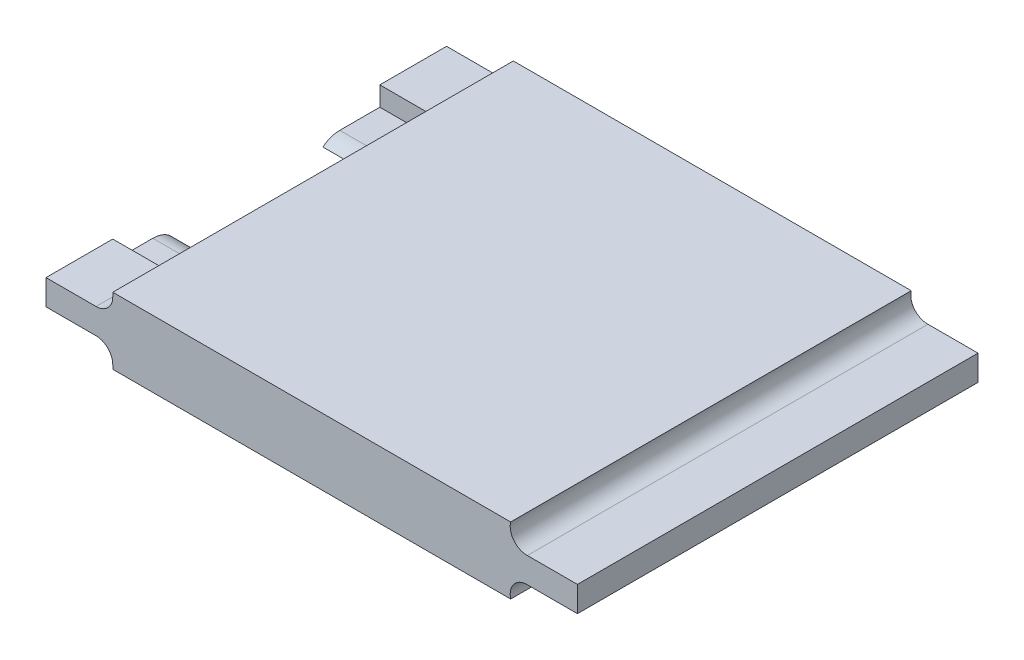
ISO-10303-21;
HEADER;
FILE_DESCRIPTION(('STEP AP214'),'2;1');
FILE_NAME('part.step','',(''),(''),'','','');
FILE_SCHEMA(('AUTOMOTIVE_DESIGN { 1 0 10303 214 1 1 1 1 }'));
ENDSEC;
DATA;
#1=APPLICATION_CONTEXT('core data for automotive mechanical design processes');
#2=APPLICATION_PROTOCOL_DEFINITION('international standard','automotive_design',2000,#1);
#3=PRODUCT_CONTEXT('',#1,'mechanical');
#4=PRODUCT('Part','Part','',(#3));
#5=PRODUCT_RELATED_PRODUCT_CATEGORY('part','',(#4));
#6=PRODUCT_DEFINITION_FORMATION('','',#4);
#7=PRODUCT_DEFINITION_CONTEXT('part definition',#1,'design');
#8=PRODUCT_DEFINITION('design','',#6,#7);
#9=PRODUCT_DEFINITION_SHAPE('','',#8);
#10=(LENGTH_UNIT() NAMED_UNIT(*) SI_UNIT(.MILLI.,.METRE.));
#11=(NAMED_UNIT(*) PLANE_ANGLE_UNIT() SI_UNIT($,.RADIAN.));
#12=(NAMED_UNIT(*) SI_UNIT($,.STERADIAN.) SOLID_ANGLE_UNIT());
#13=UNCERTAINTY_MEASURE_WITH_UNIT(LENGTH_MEASURE(1.E-05),#10,'distance_accuracy_value','');
#14=(GEOMETRIC_REPRESENTATION_CONTEXT(3) GLOBAL_UNCERTAINTY_ASSIGNED_CONTEXT((#13)) GLOBAL_UNIT_ASSIGNED_CONTEXT((#10,
#11,#12)) REPRESENTATION_CONTEXT('',''));
#15=CARTESIAN_POINT('',(0.,0.,0.));
#16=DIRECTION('',(0.,0.,1.));
#17=DIRECTION('',(1.,0.,0.));
#18=AXIS2_PLACEMENT_3D('',#15,#16,#17);
#19=CARTESIAN_POINT('',(-32.3,9.4,60.));
#20=DIRECTION('',(0.,0.,-1.));
#21=DIRECTION('',(-1.,0.,0.));
#22=AXIS2_PLACEMENT_3D('',#19,#20,#21);
#23=CYLINDRICAL_SURFACE('',#22,2.5);
#24=CARTESIAN_POINT('',(-32.3,9.4,9.99999999999999));
#25=DIRECTION('',(0.,0.,1.));
#26=DIRECTION('',(0.,-1.,0.));
#27=AXIS2_PLACEMENT_3D('',#24,#25,#26);
#28=CIRCLE('',#27,2.5);
#29=CARTESIAN_POINT('',(-30.2287684822792,7.99999999999998,9.99999999999999));
#30=VERTEX_POINT('',#29);
#31=CARTESIAN_POINT('',(-32.3,6.9,9.99999999999999));
#32=VERTEX_POINT('',#31);
#33=EDGE_CURVE('E252',#30,#32,#28,.F.);
#34=ORIENTED_EDGE('',*,*,#33,.F.);
#35=DIRECTION('',(0.,0.,-1.));
#36=VECTOR('',#35,1.);
#37=CARTESIAN_POINT('',(-30.2287684822792,8.,60.));
#38=LINE('',#37,#36);
#39=CARTESIAN_POINT('',(-30.2287684822792,8.,50.));
#40=VERTEX_POINT('',#39);
#41=EDGE_CURVE('E14',#30,#40,#38,.F.);
#42=ORIENTED_EDGE('',*,*,#41,.T.);
#43=CARTESIAN_POINT('',(-32.3,9.4,50.));
#44=DIRECTION('',(0.,0.,1.));
#45=DIRECTION('',(1.,0.,0.));
#46=AXIS2_PLACEMENT_3D('',#43,#44,#45);
#47=CIRCLE('',#46,2.5);
#48=CARTESIAN_POINT('',(-32.3,6.9,50.));
#49=VERTEX_POINT('',#48);
#50=EDGE_CURVE('E495',#40,#49,#47,.F.);
#51=ORIENTED_EDGE('',*,*,#50,.T.);
#52=DIRECTION('',(0.,0.,-1.));
#53=VECTOR('',#52,1.);
#54=CARTESIAN_POINT('',(-32.3,6.9,60.));
#55=LINE('',#54,#53);
#56=CARTESIAN_POINT('',(-32.3,6.9,60.));
#57=VERTEX_POINT('',#56);
#58=EDGE_CURVE('E317',#57,#49,#55,.T.);
#59=ORIENTED_EDGE('',*,*,#58,.F.);
#60=CARTESIAN_POINT('',(-32.3,9.4,60.));
#61=DIRECTION('',(0.,0.,1.));
#62=DIRECTION('',(1.,0.,0.));
#63=AXIS2_PLACEMENT_3D('',#60,#61,#62);
#64=CIRCLE('',#63,2.5);
#65=CARTESIAN_POINT('',(-29.8,9.4,60.));
#66=VERTEX_POINT('',#65);
#67=EDGE_CURVE('E187',#66,#57,#64,.F.);
#68=ORIENTED_EDGE('',*,*,#67,.F.);
#69=DIRECTION('',(0.,0.,-1.));
#70=VECTOR('',#69,1.);
#71=CARTESIAN_POINT('',(-29.8,9.4,60.));
#72=LINE('',#71,#70);
#73=CARTESIAN_POINT('',(-29.8,9.4,0.));
#74=VERTEX_POINT('',#73);
#75=EDGE_CURVE('E111',#66,#74,#72,.T.);
#76=ORIENTED_EDGE('',*,*,#75,.T.);
#77=CARTESIAN_POINT('',(-32.3,9.4,0.));
#78=DIRECTION('',(0.,0.,1.));
#79=DIRECTION('',(1.,0.,0.));
#80=AXIS2_PLACEMENT_3D('',#77,#78,#79);
#81=CIRCLE('',#80,2.5);
#82=CARTESIAN_POINT('',(-32.3,6.9,0.));
#83=VERTEX_POINT('',#82);
#84=EDGE_CURVE('E251',#74,#83,#81,.F.);
#85=ORIENTED_EDGE('',*,*,#84,.T.);
#86=EDGE_CURVE('E316',#32,#83,#55,.T.);
#87=ORIENTED_EDGE('',*,*,#86,.F.);
#88=EDGE_LOOP('',(#34,#42,#51,#59,#68,#76,#85,#87));
#89=FACE_BOUND('',#88,.T.);
#90=ADVANCED_FACE('F103',(#89),#23,.F.);
#91=CARTESIAN_POINT('',(0.,6.9,60.));
#92=DIRECTION('',(0.,-1.,0.));
#93=DIRECTION('',(0.,0.,-1.));
#94=AXIS2_PLACEMENT_3D('',#91,#92,#93);
#95=PLANE('',#94);
#96=DIRECTION('',(-1.,0.,0.));
#97=VECTOR('',#96,1.);
#98=CARTESIAN_POINT('',(0.,6.9,9.99999999999999));
#99=LINE('',#98,#97);
#100=CARTESIAN_POINT('',(-39.8,6.9,10.));
#101=VERTEX_POINT('',#100);
#102=EDGE_CURVE('E336',#32,#101,#99,.T.);
#103=ORIENTED_EDGE('',*,*,#102,.F.);
#104=ORIENTED_EDGE('',*,*,#86,.T.);
#105=DIRECTION('',(-1.,0.,0.));
#106=VECTOR('',#105,1.);
#107=CARTESIAN_POINT('',(0.,6.9,0.));
#108=LINE('',#107,#106);
#109=CARTESIAN_POINT('',(-39.8,6.9,0.));
#110=VERTEX_POINT('',#109);
#111=EDGE_CURVE('E255',#83,#110,#108,.T.);
#112=ORIENTED_EDGE('',*,*,#111,.T.);
#113=DIRECTION('',(0.,0.,-1.));
#114=VECTOR('',#113,1.);
#115=CARTESIAN_POINT('',(-39.8,6.9,60.));
#116=LINE('',#115,#114);
#117=EDGE_CURVE('E312',#101,#110,#116,.T.);
#118=ORIENTED_EDGE('',*,*,#117,.F.);
#119=EDGE_LOOP('',(#103,#104,#112,#118));
#120=FACE_BOUND('',#119,.T.);
#121=ADVANCED_FACE('F333',(#120),#95,.F.);
#122=CARTESIAN_POINT('',(-39.8,0.,60.));
#123=DIRECTION('',(1.,0.,0.));
#124=DIRECTION('',(0.,0.,-1.));
#125=AXIS2_PLACEMENT_3D('',#122,#123,#124);
#126=PLANE('',#125);
#127=DIRECTION('',(0.,1.,0.));
#128=VECTOR('',#127,1.);
#129=CARTESIAN_POINT('',(-39.8,0.,10.));
#130=LINE('',#129,#128);
#131=CARTESIAN_POINT('',(-39.8,3.99999999999998,10.));
#132=VERTEX_POINT('',#131);
#133=EDGE_CURVE('E552',#132,#101,#130,.T.);
#134=ORIENTED_EDGE('',*,*,#133,.T.);
#135=ORIENTED_EDGE('',*,*,#117,.T.);
#136=DIRECTION('',(0.,-1.,0.));
#137=VECTOR('',#136,1.);
#138=CARTESIAN_POINT('',(-39.8,0.,0.));
#139=LINE('',#138,#137);
#140=CARTESIAN_POINT('',(-39.8,3.1,0.));
#141=VERTEX_POINT('',#140);
#142=EDGE_CURVE('E258',#110,#141,#139,.T.);
#143=ORIENTED_EDGE('',*,*,#142,.T.);
#144=DIRECTION('',(0.,0.,-1.));
#145=VECTOR('',#144,1.);
#146=CARTESIAN_POINT('',(-39.8,3.1,60.));
#147=LINE('',#146,#145);
#148=CARTESIAN_POINT('',(-39.8,3.1,18.5278449319529));
#149=VERTEX_POINT('',#148);
#150=EDGE_CURVE('E308',#149,#141,#147,.T.);
#151=ORIENTED_EDGE('',*,*,#150,.F.);
#152=CARTESIAN_POINT('',(-39.8,0.,16.));
#153=DIRECTION('',(-1.,0.,0.));
#154=DIRECTION('',(0.,0.,1.));
#155=AXIS2_PLACEMENT_3D('',#152,#153,#154);
#156=CIRCLE('',#155,4.);
#157=CARTESIAN_POINT('',(-39.8,3.99999999999999,16.));
#158=VERTEX_POINT('',#157);
#159=EDGE_CURVE('E448',#149,#158,#156,.T.);
#160=ORIENTED_EDGE('',*,*,#159,.T.);
#161=DIRECTION('',(0.,0.,-1.));
#162=VECTOR('',#161,1.);
#163=CARTESIAN_POINT('',(-39.8,3.99999999999997,0.));
#164=LINE('',#163,#162);
#165=EDGE_CURVE('E553',#158,#132,#164,.T.);
#166=ORIENTED_EDGE('',*,*,#165,.T.);
#167=EDGE_LOOP('',(#134,#135,#143,#151,#160,#166));
#168=FACE_BOUND('',#167,.T.);
#169=ADVANCED_FACE('F549',(#168),#126,.F.);
#170=CARTESIAN_POINT('',(0.,3.1,60.));
#171=DIRECTION('',(0.,1.,0.));
#172=DIRECTION('',(0.,0.,1.));
#173=AXIS2_PLACEMENT_3D('',#170,#171,#172);
#174=PLANE('',#173);
#175=DIRECTION('',(-1.,0.,0.));
#176=VECTOR('',#175,1.);
#177=CARTESIAN_POINT('',(-22.5,3.1,18.5278449319529));
#178=LINE('',#177,#176);
#179=CARTESIAN_POINT('',(-32.3,3.1,18.5278449319529));
#180=VERTEX_POINT('',#179);
#181=EDGE_CURVE('E489',#149,#180,#178,.F.);
#182=ORIENTED_EDGE('',*,*,#181,.F.);
#183=ORIENTED_EDGE('',*,*,#150,.T.);
#184=DIRECTION('',(1.,0.,0.));
#185=VECTOR('',#184,1.);
#186=CARTESIAN_POINT('',(0.,3.1,0.));
#187=LINE('',#186,#185);
#188=CARTESIAN_POINT('',(-32.3,3.1,0.));
#189=VERTEX_POINT('',#188);
#190=EDGE_CURVE('E261',#141,#189,#187,.T.);
#191=ORIENTED_EDGE('',*,*,#190,.T.);
#192=DIRECTION('',(0.,0.,-1.));
#193=VECTOR('',#192,1.);
#194=CARTESIAN_POINT('',(-32.3,3.1,60.));
#195=LINE('',#194,#193);
#196=EDGE_CURVE('E304',#180,#189,#195,.T.);
#197=ORIENTED_EDGE('',*,*,#196,.F.);
#198=EDGE_LOOP('',(#182,#183,#191,#197));
#199=FACE_BOUND('',#198,.T.);
#200=ADVANCED_FACE('F544',(#199),#174,.F.);
#201=CARTESIAN_POINT('',(-32.3,0.6,60.));
#202=DIRECTION('',(0.,0.,-1.));
#203=DIRECTION('',(-1.,0.,0.));
#204=AXIS2_PLACEMENT_3D('',#201,#202,#203);
#205=CYLINDRICAL_SURFACE('',#204,2.5);
#206=CARTESIAN_POINT('',(-32.3,3.1,18.5278449319529));
#207=CARTESIAN_POINT('',(-32.2427783761966,3.10001959279148,18.5277991250683));
#208=CARTESIAN_POINT('',(-32.1855893792816,3.09803637255358,18.5302529364536));
#209=CARTESIAN_POINT('',(-32.0719853521432,3.09022435308074,18.5397992394586));
#210=CARTESIAN_POINT('',(-32.0155689104547,3.08440391729165,18.5468816424886));
#211=CARTESIAN_POINT('',(-31.9047785817545,3.06918800058297,18.5651929682316));
#212=CARTESIAN_POINT('',(-31.8503869073037,3.05984587918695,18.5763599313698));
#213=CARTESIAN_POINT('',(-31.7431590092011,3.03781174261047,18.6023051043512));
#214=CARTESIAN_POINT('',(-31.6903235782667,3.02511805192571,18.6170851201436));
#215=CARTESIAN_POINT('',(-31.5354590256534,2.9826171650465,18.6656754706729));
#216=CARTESIAN_POINT('',(-31.4360480065412,2.94824187650252,18.7039252808654));
#217=CARTESIAN_POINT('',(-31.2446896501938,2.86873035644089,18.7881448275677));
#218=CARTESIAN_POINT('',(-31.1527805575262,2.82354310525713,18.8341508506266));
#219=CARTESIAN_POINT('',(-30.9963446206589,2.73463586133435,18.9197069730532));
#220=CARTESIAN_POINT('',(-30.9302664153485,2.69281416602465,18.9584251649125));
#221=CARTESIAN_POINT('',(-30.8028270134512,2.60362901290673,19.0372140558415));
#222=CARTESIAN_POINT('',(-30.7414677279184,2.55626332929009,19.0772852935084));
#223=CARTESIAN_POINT('',(-30.5644075587497,2.40601512949677,19.1980509374535));
#224=CARTESIAN_POINT('',(-30.4557249325531,2.29498179128109,19.2792969452317));
#225=CARTESIAN_POINT('',(-30.3080698658128,2.11274427232646,19.3973017691196));
#226=CARTESIAN_POINT('',(-30.2612312403755,2.04904983062442,19.436164579342));
#227=CARTESIAN_POINT('',(-30.1732793689853,1.91657815157641,19.5117699845371));
#228=CARTESIAN_POINT('',(-30.1321666940749,1.84780040832418,19.5485123678285));
#229=CARTESIAN_POINT('',(-30.0563702291469,1.7057062529124,19.6189551386471));
#230=CARTESIAN_POINT('',(-30.021663123509,1.63240765089265,19.6526663199712));
#231=CARTESIAN_POINT('',(-29.9591292298411,1.481468189327,19.7164433460602));
#232=CARTESIAN_POINT('',(-29.931296576968,1.40383110093529,19.7465122869118));
#233=CARTESIAN_POINT('',(-29.889942185677,1.26721910691075,19.7944460360402));
#234=CARTESIAN_POINT('',(-29.8745982346269,1.20915731173713,19.8133608600637));
#235=CARTESIAN_POINT('',(-29.8480235320143,1.09137963440562,19.8487230444889));
#236=CARTESIAN_POINT('',(-29.8367912365485,1.03166438218993,19.8651713296895));
#237=CARTESIAN_POINT('',(-29.8185951835575,0.910492386576851,19.8955004952196));
#238=CARTESIAN_POINT('',(-29.8116614371594,0.849026465072671,19.9093628625414));
#239=CARTESIAN_POINT('',(-29.8023569407959,0.725122292391094,19.9342368046447));
#240=CARTESIAN_POINT('',(-29.7999903981387,0.662683198041175,19.9452457427746));
#241=CARTESIAN_POINT('',(-29.8,0.600000000000002,19.954743986657));
#242=B_SPLINE_CURVE_WITH_KNOTS('',3,(#206,#207,#208,#209,#210,#211,#212,#213,#214,#215,#216,
#217,#218,#219,#220,#221,#222,#223,#224,#225,#226,#227,#228,#229,#230,#231,#232,#233,#234,#235,
#236,#237,#238,#239,#240,#241),.UNSPECIFIED.,.F.,.F.,(4,2,2,2,2,2,2,2,2,2,2,2,2,2,2,2,2,4),(0.,
0.171525700600867,0.342678780968912,0.511336537257084,0.680078768482133,1.014451115412,
1.35043355143481,1.61188174328323,1.87343526411908,2.39654448615915,2.66057120517082,
2.92462423643243,3.1876963228302,3.45054319165687,3.63924805950772,3.82788199689718,
4.01781850824386,4.20792990575313),.UNSPECIFIED.);
#243=CARTESIAN_POINT('',(-29.8,0.600000000000001,19.954743986657));
#244=VERTEX_POINT('',#243);
#245=EDGE_CURVE('E484',#180,#244,#242,.T.);
#246=ORIENTED_EDGE('',*,*,#245,.F.);
#247=ORIENTED_EDGE('',*,*,#196,.T.);
#248=CARTESIAN_POINT('',(-32.3,0.6,0.));
#249=DIRECTION('',(0.,0.,1.));
#250=DIRECTION('',(1.,0.,0.));
#251=AXIS2_PLACEMENT_3D('',#248,#249,#250);
#252=CIRCLE('',#251,2.5);
#253=CARTESIAN_POINT('',(-29.8,0.600000000000001,0.));
#254=VERTEX_POINT('',#253);
#255=EDGE_CURVE('E264',#189,#254,#252,.F.);
#256=ORIENTED_EDGE('',*,*,#255,.T.);
#257=DIRECTION('',(0.,0.,-1.));
#258=VECTOR('',#257,1.);
#259=CARTESIAN_POINT('',(-29.8,0.600000000000001,60.));
#260=LINE('',#259,#258);
#261=EDGE_CURVE('E300',#244,#254,#260,.T.);
#262=ORIENTED_EDGE('',*,*,#261,.F.);
#263=EDGE_LOOP('',(#246,#247,#256,#262));
#264=FACE_BOUND('',#263,.T.);
#265=ADVANCED_FACE('F540',(#264),#205,.F.);
#266=CARTESIAN_POINT('',(-29.8,0.,60.));
#267=DIRECTION('',(1.,0.,0.));
#268=DIRECTION('',(0.,0.,-1.));
#269=AXIS2_PLACEMENT_3D('',#266,#267,#268);
#270=PLANE('',#269);
#271=CARTESIAN_POINT('',(-29.8,0.600000000000001,60.));
#272=VERTEX_POINT('',#271);
#273=CARTESIAN_POINT('',(-29.8,0.600000000000001,40.045256013343));
#274=VERTEX_POINT('',#273);
#275=EDGE_CURVE('E301',#272,#274,#260,.T.);
#276=ORIENTED_EDGE('',*,*,#275,.T.);
#277=CARTESIAN_POINT('',(-29.8,0.,44.));
#278=DIRECTION('',(1.,0.,0.));
#279=DIRECTION('',(0.,0.,-1.));
#280=AXIS2_PLACEMENT_3D('',#277,#278,#279);
#281=CIRCLE('',#280,4.);
#282=CARTESIAN_POINT('',(-29.8,0.,40.));
#283=VERTEX_POINT('',#282);
#284=EDGE_CURVE('E452',#274,#283,#281,.F.);
#285=ORIENTED_EDGE('',*,*,#284,.T.);
#286=DIRECTION('',(0.,0.,-1.));
#287=VECTOR('',#286,1.);
#288=CARTESIAN_POINT('',(-29.8,0.,60.));
#289=LINE('',#288,#287);
#290=CARTESIAN_POINT('',(-29.8,0.,60.));
#291=VERTEX_POINT('',#290);
#292=EDGE_CURVE('E297',#291,#283,#289,.T.);
#293=ORIENTED_EDGE('',*,*,#292,.F.);
#294=DIRECTION('',(0.,-1.,0.));
#295=VECTOR('',#294,1.);
#296=CARTESIAN_POINT('',(-29.8,0.,60.));
#297=LINE('',#296,#295);
#298=EDGE_CURVE('E510',#272,#291,#297,.T.);
#299=ORIENTED_EDGE('',*,*,#298,.F.);
#300=EDGE_LOOP('',(#276,#285,#293,#299));
#301=FACE_BOUND('',#300,.T.);
#302=ADVANCED_FACE('F600',(#301),#270,.F.);
#303=CARTESIAN_POINT('',(0.,0.,60.));
#304=DIRECTION('',(0.,1.,0.));
#305=DIRECTION('',(0.,0.,1.));
#306=AXIS2_PLACEMENT_3D('',#303,#304,#305);
#307=PLANE('',#306);
#308=DIRECTION('',(-1.,0.,0.));
#309=VECTOR('',#308,1.);
#310=CARTESIAN_POINT('',(-22.5,0.,20.));
#311=LINE('',#310,#309);
#312=CARTESIAN_POINT('',(-22.5,0.,20.));
#313=VERTEX_POINT('',#312);
#314=CARTESIAN_POINT('',(-29.8,0.,20.));
#315=VERTEX_POINT('',#314);
#316=EDGE_CURVE('E118',#313,#315,#311,.T.);
#317=ORIENTED_EDGE('',*,*,#316,.T.);
#318=CARTESIAN_POINT('',(-29.8,0.,0.));
#319=VERTEX_POINT('',#318);
#320=EDGE_CURVE('E296',#315,#319,#289,.T.);
#321=ORIENTED_EDGE('',*,*,#320,.T.);
#322=DIRECTION('',(1.,0.,0.));
#323=VECTOR('',#322,1.);
#324=CARTESIAN_POINT('',(0.,0.,0.));
#325=LINE('',#324,#323);
#326=CARTESIAN_POINT('',(29.8,0.,0.));
#327=VERTEX_POINT('',#326);
#328=EDGE_CURVE('E270',#319,#327,#325,.T.);
#329=ORIENTED_EDGE('',*,*,#328,.T.);
#330=DIRECTION('',(0.,0.,-1.));
#331=VECTOR('',#330,1.);
#332=CARTESIAN_POINT('',(29.8,0.,60.));
#333=LINE('',#332,#331);
#334=CARTESIAN_POINT('',(29.8,0.,60.));
#335=VERTEX_POINT('',#334);
#336=EDGE_CURVE('E294',#335,#327,#333,.T.);
#337=ORIENTED_EDGE('',*,*,#336,.F.);
#338=DIRECTION('',(1.,0.,0.));
#339=VECTOR('',#338,1.);
#340=CARTESIAN_POINT('',(0.,0.,60.));
#341=LINE('',#340,#339);
#342=EDGE_CURVE('E512',#291,#335,#341,.T.);
#343=ORIENTED_EDGE('',*,*,#342,.F.);
#344=ORIENTED_EDGE('',*,*,#292,.T.);
#345=DIRECTION('',(-1.,0.,0.));
#346=VECTOR('',#345,1.);
#347=CARTESIAN_POINT('',(-22.5,0.,40.));
#348=LINE('',#347,#346);
#349=CARTESIAN_POINT('',(-22.5,0.,40.));
#350=VERTEX_POINT('',#349);
#351=EDGE_CURVE('E417',#350,#283,#348,.T.);
#352=ORIENTED_EDGE('',*,*,#351,.F.);
#353=DIRECTION('',(0.,0.,1.));
#354=VECTOR('',#353,1.);
#355=CARTESIAN_POINT('',(-22.5,0.,0.));
#356=LINE('',#355,#354);
#357=EDGE_CURVE('E425',#313,#350,#356,.T.);
#358=ORIENTED_EDGE('',*,*,#357,.F.);
#359=EDGE_LOOP('',(#317,#321,#329,#337,#343,#344,#352,#358));
#360=FACE_BOUND('',#359,.T.);
#361=ADVANCED_FACE('F432',(#360),#307,.F.);
#362=CARTESIAN_POINT('',(-29.8,0.,60.));
#363=DIRECTION('',(1.,0.,0.));
#364=DIRECTION('',(0.,0.,-1.));
#365=AXIS2_PLACEMENT_3D('',#362,#363,#364);
#366=PLANE('',#365);
#367=DIRECTION('',(0.,-1.,0.));
#368=VECTOR('',#367,1.);
#369=CARTESIAN_POINT('',(-29.8,0.,0.));
#370=LINE('',#369,#368);
#371=CARTESIAN_POINT('',(-29.8,9.99999999999999,0.));
#372=VERTEX_POINT('',#371);
#373=EDGE_CURVE('E248',#372,#74,#370,.T.);
#374=ORIENTED_EDGE('',*,*,#373,.T.);
#375=ORIENTED_EDGE('',*,*,#75,.F.);
#376=DIRECTION('',(0.,-1.,0.));
#377=VECTOR('',#376,1.);
#378=CARTESIAN_POINT('',(-29.8,0.,60.));
#379=LINE('',#378,#377);
#380=CARTESIAN_POINT('',(-29.8,9.99999999999999,60.));
#381=VERTEX_POINT('',#380);
#382=EDGE_CURVE('E286',#381,#66,#379,.T.);
#383=ORIENTED_EDGE('',*,*,#382,.F.);
#384=DIRECTION('',(0.,0.,-1.));
#385=VECTOR('',#384,1.);
#386=CARTESIAN_POINT('',(-29.8,9.99999999999999,60.));
#387=LINE('',#386,#385);
#388=EDGE_CURVE('E244',#381,#372,#387,.T.);
#389=ORIENTED_EDGE('',*,*,#388,.T.);
#390=EDGE_LOOP('',(#374,#375,#383,#389));
#391=FACE_BOUND('',#390,.T.);
#392=ADVANCED_FACE('F105',(#391),#366,.F.);
#393=ORIENTED_EDGE('',*,*,#58,.T.);
#394=DIRECTION('',(-1.,0.,0.));
#395=VECTOR('',#394,1.);
#396=CARTESIAN_POINT('',(0.,6.9,50.));
#397=LINE('',#396,#395);
#398=CARTESIAN_POINT('',(-39.8,6.9,50.));
#399=VERTEX_POINT('',#398);
#400=EDGE_CURVE('E492',#49,#399,#397,.T.);
#401=ORIENTED_EDGE('',*,*,#400,.T.);
#402=CARTESIAN_POINT('',(-39.8,6.9,60.));
#403=VERTEX_POINT('',#402);
#404=EDGE_CURVE('E313',#403,#399,#116,.T.);
#405=ORIENTED_EDGE('',*,*,#404,.F.);
#406=DIRECTION('',(-1.,0.,0.));
#407=VECTOR('',#406,1.);
#408=CARTESIAN_POINT('',(0.,6.9,60.));
#409=LINE('',#408,#407);
#410=EDGE_CURVE('E502',#57,#403,#409,.T.);
#411=ORIENTED_EDGE('',*,*,#410,.F.);
#412=EDGE_LOOP('',(#393,#401,#405,#411));
#413=FACE_BOUND('',#412,.T.);
#414=ADVANCED_FACE('F582',(#413),#95,.F.);
#415=DIRECTION('',(0.,0.,1.));
#416=VECTOR('',#415,1.);
#417=CARTESIAN_POINT('',(-39.8,4.,0.));
#418=LINE('',#417,#416);
#419=CARTESIAN_POINT('',(-39.8,4.,44.));
#420=VERTEX_POINT('',#419);
#421=CARTESIAN_POINT('',(-39.8,4.,50.));
#422=VERTEX_POINT('',#421);
#423=EDGE_CURVE('E558',#420,#422,#418,.T.);
#424=ORIENTED_EDGE('',*,*,#423,.F.);
#425=CARTESIAN_POINT('',(-39.8,0.,44.));
#426=DIRECTION('',(-1.,0.,0.));
#427=DIRECTION('',(0.,0.,1.));
#428=AXIS2_PLACEMENT_3D('',#425,#426,#427);
#429=CIRCLE('',#428,4.);
#430=CARTESIAN_POINT('',(-39.8,3.1,41.4721550680471));
#431=VERTEX_POINT('',#430);
#432=EDGE_CURVE('E575',#431,#420,#429,.F.);
#433=ORIENTED_EDGE('',*,*,#432,.F.);
#434=CARTESIAN_POINT('',(-39.8,3.1,60.));
#435=VERTEX_POINT('',#434);
#436=EDGE_CURVE('E309',#435,#431,#147,.T.);
#437=ORIENTED_EDGE('',*,*,#436,.F.);
#438=DIRECTION('',(0.,-1.,0.));
#439=VECTOR('',#438,1.);
#440=CARTESIAN_POINT('',(-39.8,0.,60.));
#441=LINE('',#440,#439);
#442=EDGE_CURVE('E504',#403,#435,#441,.T.);
#443=ORIENTED_EDGE('',*,*,#442,.F.);
#444=ORIENTED_EDGE('',*,*,#404,.T.);
#445=DIRECTION('',(0.,1.,0.));
#446=VECTOR('',#445,1.);
#447=CARTESIAN_POINT('',(-39.8,0.,50.));
#448=LINE('',#447,#446);
#449=EDGE_CURVE('E555',#422,#399,#448,.T.);
#450=ORIENTED_EDGE('',*,*,#449,.F.);
#451=EDGE_LOOP('',(#424,#433,#437,#443,#444,#450));
#452=FACE_BOUND('',#451,.T.);
#453=ADVANCED_FACE('F576',(#452),#126,.F.);
#454=ORIENTED_EDGE('',*,*,#436,.T.);
#455=DIRECTION('',(-1.,0.,0.));
#456=VECTOR('',#455,1.);
#457=CARTESIAN_POINT('',(-22.5,3.1,41.4721550680471));
#458=LINE('',#457,#456);
#459=CARTESIAN_POINT('',(-32.3,3.1,41.4721550680471));
#460=VERTEX_POINT('',#459);
#461=EDGE_CURVE('E463',#431,#460,#458,.F.);
#462=ORIENTED_EDGE('',*,*,#461,.T.);
#463=CARTESIAN_POINT('',(-32.3,3.1,60.));
#464=VERTEX_POINT('',#463);
#465=EDGE_CURVE('E305',#464,#460,#195,.T.);
#466=ORIENTED_EDGE('',*,*,#465,.F.);
#467=DIRECTION('',(1.,0.,0.));
#468=VECTOR('',#467,1.);
#469=CARTESIAN_POINT('',(0.,3.1,60.));
#470=LINE('',#469,#468);
#471=EDGE_CURVE('E506',#435,#464,#470,.T.);
#472=ORIENTED_EDGE('',*,*,#471,.F.);
#473=EDGE_LOOP('',(#454,#462,#466,#472));
#474=FACE_BOUND('',#473,.T.);
#475=ADVANCED_FACE('F593',(#474),#174,.F.);
#476=ORIENTED_EDGE('',*,*,#465,.T.);
#477=CARTESIAN_POINT('',(-32.3,3.1,41.4721550680471));
#478=CARTESIAN_POINT('',(-32.2427783761966,3.10001959279148,41.4722008749316));
#479=CARTESIAN_POINT('',(-32.1855893792816,3.09803637255358,41.4697470635464));
#480=CARTESIAN_POINT('',(-32.0719853521432,3.09022435308074,41.4602007605414));
#481=CARTESIAN_POINT('',(-32.0155689104547,3.08440391729165,41.4531183575114));
#482=CARTESIAN_POINT('',(-31.9047785817545,3.06918800058297,41.4348070317683));
#483=CARTESIAN_POINT('',(-31.8503869073037,3.05984587918694,41.4236400686301));
#484=CARTESIAN_POINT('',(-31.743159009201,3.03781174261046,41.3976948956488));
#485=CARTESIAN_POINT('',(-31.6903235782667,3.02511805192571,41.3829148798564));
#486=CARTESIAN_POINT('',(-31.5354590256533,2.98261716504649,41.3343245293271));
#487=CARTESIAN_POINT('',(-31.4360480065412,2.94824187650252,41.2960747191346));
#488=CARTESIAN_POINT('',(-31.2446896501938,2.86873035644089,41.2118551724323));
#489=CARTESIAN_POINT('',(-31.1527805575262,2.82354310525713,41.1658491493734));
#490=CARTESIAN_POINT('',(-30.9963446206589,2.73463586133435,41.0802930269467));
#491=CARTESIAN_POINT('',(-30.9302664153485,2.69281416602465,41.0415748350874));
#492=CARTESIAN_POINT('',(-30.8028270134512,2.60362901290673,40.9627859441585));
#493=CARTESIAN_POINT('',(-30.7414677279184,2.55626332929008,40.9227147064916));
#494=CARTESIAN_POINT('',(-30.5644075587497,2.40601512949677,40.8019490625465));
#495=CARTESIAN_POINT('',(-30.4557249325531,2.29498179128108,40.7207030547682));
#496=CARTESIAN_POINT('',(-30.3080698658128,2.11274427232645,40.6026982308804));
#497=CARTESIAN_POINT('',(-30.2612312403754,2.04904983062441,40.563835420658));
#498=CARTESIAN_POINT('',(-30.1732793689853,1.9165781515764,40.4882300154629));
#499=CARTESIAN_POINT('',(-30.1321666940749,1.84780040832417,40.4514876321715));
#500=CARTESIAN_POINT('',(-30.0563702291469,1.7057062529124,40.3810448613529));
#501=CARTESIAN_POINT('',(-30.021663123509,1.63240765089265,40.3473336800287));
#502=CARTESIAN_POINT('',(-29.9591292298411,1.48146818932699,40.2835566539398));
#503=CARTESIAN_POINT('',(-29.931296576968,1.40383110093528,40.2534877130882));
#504=CARTESIAN_POINT('',(-29.889942185677,1.26721910691074,40.2055539639598));
#505=CARTESIAN_POINT('',(-29.8745982346269,1.20915731173713,40.1866391399363));
#506=CARTESIAN_POINT('',(-29.8480235320143,1.09137963440562,40.1512769555111));
#507=CARTESIAN_POINT('',(-29.8367912365485,1.03166438218993,40.1348286703105));
#508=CARTESIAN_POINT('',(-29.8185951835575,0.910492386576847,40.1044995047804));
#509=CARTESIAN_POINT('',(-29.8116614371594,0.849026465072668,40.0906371374586));
#510=CARTESIAN_POINT('',(-29.8023569407959,0.725122292391092,40.0657631953553));
#511=CARTESIAN_POINT('',(-29.7999903981387,0.662683198041174,40.0547542572254));
#512=CARTESIAN_POINT('',(-29.8,0.600000000000001,40.045256013343));
#513=B_SPLINE_CURVE_WITH_KNOTS('',3,(#477,#478,#479,#480,#481,#482,#483,#484,#485,#486,#487,
#488,#489,#490,#491,#492,#493,#494,#495,#496,#497,#498,#499,#500,#501,#502,#503,#504,#505,#506,
#507,#508,#509,#510,#511,#512),.UNSPECIFIED.,.F.,.F.,(4,2,2,2,2,2,2,2,2,2,2,2,2,2,2,2,2,4),(0.,
0.171525700600874,0.342678780968918,0.511336537257091,0.680078768482141,1.01445111541201,
1.35043355143482,1.61188174328323,1.87343526411909,2.39654448615916,2.66057120517083,
2.92462423643243,3.1876963228302,3.45054319165687,3.63924805950772,3.82788199689718,
4.01781850824386,4.20792990575313),.UNSPECIFIED.);
#514=EDGE_CURVE('E454',#460,#274,#513,.T.);
#515=ORIENTED_EDGE('',*,*,#514,.T.);
#516=ORIENTED_EDGE('',*,*,#275,.F.);
#517=CARTESIAN_POINT('',(-32.3,0.6,60.));
#518=DIRECTION('',(0.,0.,1.));
#519=DIRECTION('',(1.,0.,0.));
#520=AXIS2_PLACEMENT_3D('',#517,#518,#519);
#521=CIRCLE('',#520,2.5);
#522=EDGE_CURVE('E508',#464,#272,#521,.F.);
#523=ORIENTED_EDGE('',*,*,#522,.F.);
#524=EDGE_LOOP('',(#476,#515,#516,#523));
#525=FACE_BOUND('',#524,.T.);
#526=ADVANCED_FACE('F465',(#525),#205,.F.);
#527=CARTESIAN_POINT('',(-29.8,0.,16.));
#528=DIRECTION('',(1.,0.,0.));
#529=DIRECTION('',(0.,0.,-1.));
#530=AXIS2_PLACEMENT_3D('',#527,#528,#529);
#531=CIRCLE('',#530,4.);
#532=EDGE_CURVE('E490',#244,#315,#531,.T.);
#533=ORIENTED_EDGE('',*,*,#532,.F.);
#534=ORIENTED_EDGE('',*,*,#261,.T.);
#535=DIRECTION('',(0.,-1.,0.));
#536=VECTOR('',#535,1.);
#537=CARTESIAN_POINT('',(-29.8,0.,0.));
#538=LINE('',#537,#536);
#539=EDGE_CURVE('E267',#254,#319,#538,.T.);
#540=ORIENTED_EDGE('',*,*,#539,.T.);
#541=ORIENTED_EDGE('',*,*,#320,.F.);
#542=EDGE_LOOP('',(#533,#534,#540,#541));
#543=FACE_BOUND('',#542,.T.);
#544=ADVANCED_FACE('F536',(#543),#270,.F.);
#545=CARTESIAN_POINT('',(32.2266659998307,0.601075806588127,60.));
#546=DIRECTION('',(0.,0.,-1.));
#547=DIRECTION('',(-1.,0.,0.));
#548=AXIS2_PLACEMENT_3D('',#545,#546,#547);
#549=CYLINDRICAL_SURFACE('',#548,2.5);
#550=CARTESIAN_POINT('',(32.2266659998307,0.601075806588127,0.));
#551=DIRECTION('',(0.,0.,1.));
#552=DIRECTION('',(1.,0.,0.));
#553=AXIS2_PLACEMENT_3D('',#550,#551,#552);
#554=CIRCLE('',#553,2.5);
#555=CARTESIAN_POINT('',(32.3,3.1,0.));
#556=VERTEX_POINT('',#555);
#557=EDGE_CURVE('E273',#556,#327,#554,.T.);
#558=ORIENTED_EDGE('',*,*,#557,.F.);
#559=DIRECTION('',(0.,0.,-1.));
#560=VECTOR('',#559,1.);
#561=CARTESIAN_POINT('',(32.3,3.1,60.));
#562=LINE('',#561,#560);
#563=CARTESIAN_POINT('',(32.3,3.1,60.));
#564=VERTEX_POINT('',#563);
#565=EDGE_CURVE('E292',#564,#556,#562,.T.);
#566=ORIENTED_EDGE('',*,*,#565,.F.);
#567=CARTESIAN_POINT('',(32.2266659998307,0.601075806588127,60.));
#568=DIRECTION('',(0.,0.,1.));
#569=DIRECTION('',(1.,0.,0.));
#570=AXIS2_PLACEMENT_3D('',#567,#568,#569);
#571=CIRCLE('',#570,2.5);
#572=EDGE_CURVE('E514',#564,#335,#571,.T.);
#573=ORIENTED_EDGE('',*,*,#572,.T.);
#574=ORIENTED_EDGE('',*,*,#336,.T.);
#575=EDGE_LOOP('',(#558,#566,#573,#574));
#576=FACE_BOUND('',#575,.T.);
#577=ADVANCED_FACE('F529',(#576),#549,.F.);
#578=CARTESIAN_POINT('',(0.,3.1,60.));
#579=DIRECTION('',(0.,-1.,0.));
#580=DIRECTION('',(0.,0.,-1.));
#581=AXIS2_PLACEMENT_3D('',#578,#579,#580);
#582=PLANE('',#581);
#583=DIRECTION('',(-1.,0.,0.));
#584=VECTOR('',#583,1.);
#585=CARTESIAN_POINT('',(0.,3.1,0.));
#586=LINE('',#585,#584);
#587=CARTESIAN_POINT('',(39.8,3.1,0.));
#588=VERTEX_POINT('',#587);
#589=EDGE_CURVE('E276',#588,#556,#586,.T.);
#590=ORIENTED_EDGE('',*,*,#589,.F.);
#591=DIRECTION('',(0.,0.,-1.));
#592=VECTOR('',#591,1.);
#593=CARTESIAN_POINT('',(39.8,3.1,60.));
#594=LINE('',#593,#592);
#595=CARTESIAN_POINT('',(39.8,3.1,60.));
#596=VERTEX_POINT('',#595);
#597=EDGE_CURVE('E290',#596,#588,#594,.T.);
#598=ORIENTED_EDGE('',*,*,#597,.F.);
#599=DIRECTION('',(-1.,0.,0.));
#600=VECTOR('',#599,1.);
#601=CARTESIAN_POINT('',(0.,3.1,60.));
#602=LINE('',#601,#600);
#603=EDGE_CURVE('E517',#596,#564,#602,.T.);
#604=ORIENTED_EDGE('',*,*,#603,.T.);
#605=ORIENTED_EDGE('',*,*,#565,.T.);
#606=EDGE_LOOP('',(#590,#598,#604,#605));
#607=FACE_BOUND('',#606,.T.);
#608=ADVANCED_FACE('F526',(#607),#582,.T.);
#609=CARTESIAN_POINT('',(39.8,0.,60.));
#610=DIRECTION('',(1.,0.,0.));
#611=DIRECTION('',(0.,0.,-1.));
#612=AXIS2_PLACEMENT_3D('',#609,#610,#611);
#613=PLANE('',#612);
#614=DIRECTION('',(0.,-1.,0.));
#615=VECTOR('',#614,1.);
#616=CARTESIAN_POINT('',(39.8,0.,0.));
#617=LINE('',#616,#615);
#618=CARTESIAN_POINT('',(39.8,6.9,0.));
#619=VERTEX_POINT('',#618);
#620=EDGE_CURVE('E279',#619,#588,#617,.T.);
#621=ORIENTED_EDGE('',*,*,#620,.F.);
#622=DIRECTION('',(0.,0.,-1.));
#623=VECTOR('',#622,1.);
#624=CARTESIAN_POINT('',(39.8,6.9,60.));
#625=LINE('',#624,#623);
#626=CARTESIAN_POINT('',(39.8,6.9,60.));
#627=VERTEX_POINT('',#626);
#628=EDGE_CURVE('E232',#627,#619,#625,.T.);
#629=ORIENTED_EDGE('',*,*,#628,.F.);
#630=DIRECTION('',(0.,-1.,0.));
#631=VECTOR('',#630,1.);
#632=CARTESIAN_POINT('',(39.8,0.,60.));
#633=LINE('',#632,#631);
#634=EDGE_CURVE('E240',#627,#596,#633,.T.);
#635=ORIENTED_EDGE('',*,*,#634,.T.);
#636=ORIENTED_EDGE('',*,*,#597,.T.);
#637=EDGE_LOOP('',(#621,#629,#635,#636));
#638=FACE_BOUND('',#637,.T.);
#639=ADVANCED_FACE('F521',(#638),#613,.T.);
#640=CARTESIAN_POINT('',(0.,6.9,60.));
#641=DIRECTION('',(0.,1.,0.));
#642=DIRECTION('',(0.,0.,1.));
#643=AXIS2_PLACEMENT_3D('',#640,#641,#642);
#644=PLANE('',#643);
#645=DIRECTION('',(1.,0.,0.));
#646=VECTOR('',#645,1.);
#647=CARTESIAN_POINT('',(0.,6.9,0.));
#648=LINE('',#647,#646);
#649=CARTESIAN_POINT('',(32.3,6.9,0.));
#650=VERTEX_POINT('',#649);
#651=EDGE_CURVE('E227',#650,#619,#648,.T.);
#652=ORIENTED_EDGE('',*,*,#651,.F.);
#653=DIRECTION('',(0.,0.,-1.));
#654=VECTOR('',#653,1.);
#655=CARTESIAN_POINT('',(32.3,6.9,60.));
#656=LINE('',#655,#654);
#657=CARTESIAN_POINT('',(32.3,6.9,60.));
#658=VERTEX_POINT('',#657);
#659=EDGE_CURVE('E222',#658,#650,#656,.T.);
#660=ORIENTED_EDGE('',*,*,#659,.F.);
#661=DIRECTION('',(1.,0.,0.));
#662=VECTOR('',#661,1.);
#663=CARTESIAN_POINT('',(0.,6.9,60.));
#664=LINE('',#663,#662);
#665=EDGE_CURVE('E225',#658,#627,#664,.T.);
#666=ORIENTED_EDGE('',*,*,#665,.T.);
#667=ORIENTED_EDGE('',*,*,#628,.T.);
#668=EDGE_LOOP('',(#652,#660,#666,#667));
#669=FACE_BOUND('',#668,.T.);
#670=ADVANCED_FACE('F224',(#669),#644,.T.);
#671=CARTESIAN_POINT('',(32.2266659998307,9.39892419341187,60.));
#672=DIRECTION('',(0.,0.,-1.));
#673=DIRECTION('',(-1.,0.,0.));
#674=AXIS2_PLACEMENT_3D('',#671,#672,#673);
#675=CYLINDRICAL_SURFACE('',#674,2.5);
#676=CARTESIAN_POINT('',(32.2266659998307,9.39892419341187,0.));
#677=DIRECTION('',(0.,0.,1.));
#678=DIRECTION('',(1.,0.,0.));
#679=AXIS2_PLACEMENT_3D('',#676,#677,#678);
#680=CIRCLE('',#679,2.5);
#681=CARTESIAN_POINT('',(29.8,9.99999999999999,0.));
#682=VERTEX_POINT('',#681);
#683=EDGE_CURVE('E283',#682,#650,#680,.T.);
#684=ORIENTED_EDGE('',*,*,#683,.F.);
#685=DIRECTION('',(0.,0.,-1.));
#686=VECTOR('',#685,1.);
#687=CARTESIAN_POINT('',(29.8,9.99999999999999,60.));
#688=LINE('',#687,#686);
#689=CARTESIAN_POINT('',(29.8,9.99999999999999,60.));
#690=VERTEX_POINT('',#689);
#691=EDGE_CURVE('E233',#690,#682,#688,.T.);
#692=ORIENTED_EDGE('',*,*,#691,.F.);
#693=CARTESIAN_POINT('',(32.2266659998307,9.39892419341187,60.));
#694=DIRECTION('',(0.,0.,1.));
#695=DIRECTION('',(1.,0.,0.));
#696=AXIS2_PLACEMENT_3D('',#693,#694,#695);
#697=CIRCLE('',#696,2.5);
#698=EDGE_CURVE('E237',#690,#658,#697,.T.);
#699=ORIENTED_EDGE('',*,*,#698,.T.);
#700=ORIENTED_EDGE('',*,*,#659,.T.);
#701=EDGE_LOOP('',(#684,#692,#699,#700));
#702=FACE_BOUND('',#701,.T.);
#703=ADVANCED_FACE('F242',(#702),#675,.F.);
#704=CARTESIAN_POINT('',(0.,9.99999999999999,60.));
#705=DIRECTION('',(0.,-1.,0.));
#706=DIRECTION('',(0.,0.,-1.));
#707=AXIS2_PLACEMENT_3D('',#704,#705,#706);
#708=PLANE('',#707);
#709=DIRECTION('',(-1.,0.,0.));
#710=VECTOR('',#709,1.);
#711=CARTESIAN_POINT('',(0.,9.99999999999999,0.));
#712=LINE('',#711,#710);
#713=EDGE_CURVE('E178',#682,#372,#712,.T.);
#714=ORIENTED_EDGE('',*,*,#713,.T.);
#715=ORIENTED_EDGE('',*,*,#388,.F.);
#716=DIRECTION('',(-1.,0.,0.));
#717=VECTOR('',#716,1.);
#718=CARTESIAN_POINT('',(0.,9.99999999999999,60.));
#719=LINE('',#718,#717);
#720=EDGE_CURVE('E127',#690,#381,#719,.T.);
#721=ORIENTED_EDGE('',*,*,#720,.F.);
#722=ORIENTED_EDGE('',*,*,#691,.T.);
#723=EDGE_LOOP('',(#714,#715,#721,#722));
#724=FACE_BOUND('',#723,.T.);
#725=ADVANCED_FACE('F655',(#724),#708,.F.);
#726=CARTESIAN_POINT('',(0.,0.,60.));
#727=DIRECTION('',(0.,0.,1.));
#728=DIRECTION('',(1.,0.,0.));
#729=AXIS2_PLACEMENT_3D('',#726,#727,#728);
#730=PLANE('',#729);
#731=ORIENTED_EDGE('',*,*,#382,.T.);
#732=ORIENTED_EDGE('',*,*,#67,.T.);
#733=ORIENTED_EDGE('',*,*,#410,.T.);
#734=ORIENTED_EDGE('',*,*,#442,.T.);
#735=ORIENTED_EDGE('',*,*,#471,.T.);
#736=ORIENTED_EDGE('',*,*,#522,.T.);
#737=ORIENTED_EDGE('',*,*,#298,.T.);
#738=ORIENTED_EDGE('',*,*,#342,.T.);
#739=ORIENTED_EDGE('',*,*,#572,.F.);
#740=ORIENTED_EDGE('',*,*,#603,.F.);
#741=ORIENTED_EDGE('',*,*,#634,.F.);
#742=ORIENTED_EDGE('',*,*,#665,.F.);
#743=ORIENTED_EDGE('',*,*,#698,.F.);
#744=ORIENTED_EDGE('',*,*,#720,.T.);
#745=EDGE_LOOP('',(#731,#732,#733,#734,#735,#736,#737,#738,#739,#740,#741,#742,#743,#744));
#746=FACE_BOUND('',#745,.T.);
#747=ADVANCED_FACE('F236',(#746),#730,.T.);
#748=CARTESIAN_POINT('',(0.,0.,0.));
#749=DIRECTION('',(0.,0.,1.));
#750=DIRECTION('',(1.,0.,0.));
#751=AXIS2_PLACEMENT_3D('',#748,#749,#750);
#752=PLANE('',#751);
#753=ORIENTED_EDGE('',*,*,#373,.F.);
#754=ORIENTED_EDGE('',*,*,#713,.F.);
#755=ORIENTED_EDGE('',*,*,#683,.T.);
#756=ORIENTED_EDGE('',*,*,#651,.T.);
#757=ORIENTED_EDGE('',*,*,#620,.T.);
#758=ORIENTED_EDGE('',*,*,#589,.T.);
#759=ORIENTED_EDGE('',*,*,#557,.T.);
#760=ORIENTED_EDGE('',*,*,#328,.F.);
#761=ORIENTED_EDGE('',*,*,#539,.F.);
#762=ORIENTED_EDGE('',*,*,#255,.F.);
#763=ORIENTED_EDGE('',*,*,#190,.F.);
#764=ORIENTED_EDGE('',*,*,#142,.F.);
#765=ORIENTED_EDGE('',*,*,#111,.F.);
#766=ORIENTED_EDGE('',*,*,#84,.F.);
#767=EDGE_LOOP('',(#753,#754,#755,#756,#757,#758,#759,#760,#761,#762,#763,#764,#765,#766));
#768=FACE_BOUND('',#767,.T.);
#769=ADVANCED_FACE('F327',(#768),#752,.F.);
#770=CARTESIAN_POINT('',(-22.5,8.,50.));
#771=DIRECTION('',(0.,1.,0.));
#772=DIRECTION('',(0.,0.,1.));
#773=AXIS2_PLACEMENT_3D('',#770,#771,#772);
#774=PLANE('',#773);
#775=DIRECTION('',(-1.,0.,0.));
#776=VECTOR('',#775,1.);
#777=CARTESIAN_POINT('',(-22.5,7.99999999999998,9.99999999999999));
#778=LINE('',#777,#776);
#779=CARTESIAN_POINT('',(-22.5,7.99999999999998,9.99999999999999));
#780=VERTEX_POINT('',#779);
#781=EDGE_CURVE('E449',#780,#30,#778,.T.);
#782=ORIENTED_EDGE('',*,*,#781,.F.);
#783=DIRECTION('',(0.,0.,-1.));
#784=VECTOR('',#783,1.);
#785=CARTESIAN_POINT('',(-22.5,8.,50.));
#786=LINE('',#785,#784);
#787=CARTESIAN_POINT('',(-22.5,8.,50.));
#788=VERTEX_POINT('',#787);
#789=EDGE_CURVE('E443',#788,#780,#786,.T.);
#790=ORIENTED_EDGE('',*,*,#789,.F.);
#791=DIRECTION('',(-1.,0.,0.));
#792=VECTOR('',#791,1.);
#793=CARTESIAN_POINT('',(-22.5,8.,50.));
#794=LINE('',#793,#792);
#795=EDGE_CURVE('E446',#788,#40,#794,.T.);
#796=ORIENTED_EDGE('',*,*,#795,.T.);
#797=ORIENTED_EDGE('',*,*,#41,.F.);
#798=EDGE_LOOP('',(#782,#790,#796,#797));
#799=FACE_BOUND('',#798,.T.);
#800=ADVANCED_FACE('F481',(#799),#774,.F.);
#801=CARTESIAN_POINT('',(-22.5,0.,10.));
#802=DIRECTION('',(0.,0.,1.));
#803=DIRECTION('',(0.,-1.,0.));
#804=AXIS2_PLACEMENT_3D('',#801,#802,#803);
#805=PLANE('',#804);
#806=ORIENTED_EDGE('',*,*,#33,.T.);
#807=ORIENTED_EDGE('',*,*,#102,.T.);
#808=ORIENTED_EDGE('',*,*,#133,.F.);
#809=DIRECTION('',(-1.,0.,0.));
#810=VECTOR('',#809,1.);
#811=CARTESIAN_POINT('',(-22.5,3.99999999999998,10.));
#812=LINE('',#811,#810);
#813=CARTESIAN_POINT('',(-22.5,3.99999999999998,10.));
#814=VERTEX_POINT('',#813);
#815=EDGE_CURVE('E564',#814,#132,#812,.T.);
#816=ORIENTED_EDGE('',*,*,#815,.F.);
#817=DIRECTION('',(0.,1.,0.));
#818=VECTOR('',#817,1.);
#819=CARTESIAN_POINT('',(-22.5,0.,10.));
#820=LINE('',#819,#818);
#821=EDGE_CURVE('E439',#814,#780,#820,.T.);
#822=ORIENTED_EDGE('',*,*,#821,.T.);
#823=ORIENTED_EDGE('',*,*,#781,.T.);
#824=EDGE_LOOP('',(#806,#807,#808,#816,#822,#823));
#825=FACE_BOUND('',#824,.T.);
#826=ADVANCED_FACE('F745',(#825),#805,.T.);
#827=CARTESIAN_POINT('',(-22.5,0.,50.));
#828=DIRECTION('',(0.,0.,1.));
#829=DIRECTION('',(1.,0.,0.));
#830=AXIS2_PLACEMENT_3D('',#827,#828,#829);
#831=PLANE('',#830);
#832=ORIENTED_EDGE('',*,*,#795,.F.);
#833=DIRECTION('',(0.,1.,0.));
#834=VECTOR('',#833,1.);
#835=CARTESIAN_POINT('',(-22.5,0.,50.));
#836=LINE('',#835,#834);
#837=CARTESIAN_POINT('',(-22.5,4.,50.));
#838=VERTEX_POINT('',#837);
#839=EDGE_CURVE('E570',#838,#788,#836,.T.);
#840=ORIENTED_EDGE('',*,*,#839,.F.);
#841=DIRECTION('',(-1.,0.,0.));
#842=VECTOR('',#841,1.);
#843=CARTESIAN_POINT('',(-22.5,4.,50.));
#844=LINE('',#843,#842);
#845=EDGE_CURVE('E437',#838,#422,#844,.T.);
#846=ORIENTED_EDGE('',*,*,#845,.T.);
#847=ORIENTED_EDGE('',*,*,#449,.T.);
#848=ORIENTED_EDGE('',*,*,#400,.F.);
#849=ORIENTED_EDGE('',*,*,#50,.F.);
#850=EDGE_LOOP('',(#832,#840,#846,#847,#848,#849));
#851=FACE_BOUND('',#850,.T.);
#852=ADVANCED_FACE('F480',(#851),#831,.F.);
#853=CARTESIAN_POINT('',(-22.5,0.,16.));
#854=DIRECTION('',(-1.,0.,0.));
#855=DIRECTION('',(0.,0.,1.));
#856=AXIS2_PLACEMENT_3D('',#853,#854,#855);
#857=CYLINDRICAL_SURFACE('',#856,4.);
#858=ORIENTED_EDGE('',*,*,#181,.T.);
#859=ORIENTED_EDGE('',*,*,#245,.T.);
#860=ORIENTED_EDGE('',*,*,#532,.T.);
#861=ORIENTED_EDGE('',*,*,#316,.F.);
#862=CARTESIAN_POINT('',(-22.5,0.,16.));
#863=DIRECTION('',(-1.,0.,0.));
#864=DIRECTION('',(0.,0.,1.));
#865=AXIS2_PLACEMENT_3D('',#862,#863,#864);
#866=CIRCLE('',#865,4.);
#867=CARTESIAN_POINT('',(-22.5,3.99999999999999,16.));
#868=VERTEX_POINT('',#867);
#869=EDGE_CURVE('E429',#313,#868,#866,.T.);
#870=ORIENTED_EDGE('',*,*,#869,.T.);
#871=DIRECTION('',(-1.,0.,0.));
#872=VECTOR('',#871,1.);
#873=CARTESIAN_POINT('',(-22.5,3.99999999999999,16.));
#874=LINE('',#873,#872);
#875=EDGE_CURVE('E455',#868,#158,#874,.T.);
#876=ORIENTED_EDGE('',*,*,#875,.T.);
#877=ORIENTED_EDGE('',*,*,#159,.F.);
#878=EDGE_LOOP('',(#858,#859,#860,#861,#870,#876,#877));
#879=FACE_BOUND('',#878,.T.);
#880=ADVANCED_FACE('F474',(#879),#857,.T.);
#881=CARTESIAN_POINT('',(-22.5,0.,44.));
#882=DIRECTION('',(-1.,0.,0.));
#883=DIRECTION('',(0.,0.,1.));
#884=AXIS2_PLACEMENT_3D('',#881,#882,#883);
#885=CYLINDRICAL_SURFACE('',#884,4.);
#886=ORIENTED_EDGE('',*,*,#432,.T.);
#887=DIRECTION('',(-1.,0.,0.));
#888=VECTOR('',#887,1.);
#889=CARTESIAN_POINT('',(-22.5,4.,44.));
#890=LINE('',#889,#888);
#891=CARTESIAN_POINT('',(-22.5,4.,44.));
#892=VERTEX_POINT('',#891);
#893=EDGE_CURVE('E420',#892,#420,#890,.T.);
#894=ORIENTED_EDGE('',*,*,#893,.F.);
#895=CARTESIAN_POINT('',(-22.5,0.,44.));
#896=DIRECTION('',(-1.,0.,0.));
#897=DIRECTION('',(0.,0.,1.));
#898=AXIS2_PLACEMENT_3D('',#895,#896,#897);
#899=CIRCLE('',#898,4.);
#900=EDGE_CURVE('E413',#350,#892,#899,.F.);
#901=ORIENTED_EDGE('',*,*,#900,.F.);
#902=ORIENTED_EDGE('',*,*,#351,.T.);
#903=ORIENTED_EDGE('',*,*,#284,.F.);
#904=ORIENTED_EDGE('',*,*,#514,.F.);
#905=ORIENTED_EDGE('',*,*,#461,.F.);
#906=EDGE_LOOP('',(#886,#894,#901,#902,#903,#904,#905));
#907=FACE_BOUND('',#906,.T.);
#908=ADVANCED_FACE('F415',(#907),#885,.T.);
#909=CARTESIAN_POINT('',(-22.5,3.99999999999997,0.));
#910=DIRECTION('',(0.,1.,0.));
#911=DIRECTION('',(0.,0.,1.));
#912=AXIS2_PLACEMENT_3D('',#909,#910,#911);
#913=PLANE('',#912);
#914=ORIENTED_EDGE('',*,*,#165,.F.);
#915=ORIENTED_EDGE('',*,*,#875,.F.);
#916=DIRECTION('',(0.,0.,-1.));
#917=VECTOR('',#916,1.);
#918=CARTESIAN_POINT('',(-22.5,3.99999999999997,0.));
#919=LINE('',#918,#917);
#920=EDGE_CURVE('E435',#868,#814,#919,.T.);
#921=ORIENTED_EDGE('',*,*,#920,.T.);
#922=ORIENTED_EDGE('',*,*,#815,.T.);
#923=EDGE_LOOP('',(#914,#915,#921,#922));
#924=FACE_BOUND('',#923,.T.);
#925=ADVANCED_FACE('F473',(#924),#913,.T.);
#926=CARTESIAN_POINT('',(-22.5,4.,0.));
#927=DIRECTION('',(0.,-1.,0.));
#928=DIRECTION('',(0.,0.,-1.));
#929=AXIS2_PLACEMENT_3D('',#926,#927,#928);
#930=PLANE('',#929);
#931=ORIENTED_EDGE('',*,*,#423,.T.);
#932=ORIENTED_EDGE('',*,*,#845,.F.);
#933=DIRECTION('',(0.,0.,1.));
#934=VECTOR('',#933,1.);
#935=CARTESIAN_POINT('',(-22.5,4.,0.));
#936=LINE('',#935,#934);
#937=EDGE_CURVE('E424',#892,#838,#936,.T.);
#938=ORIENTED_EDGE('',*,*,#937,.F.);
#939=ORIENTED_EDGE('',*,*,#893,.T.);
#940=EDGE_LOOP('',(#931,#932,#938,#939));
#941=FACE_BOUND('',#940,.T.);
#942=ADVANCED_FACE('F475',(#941),#930,.F.);
#943=CARTESIAN_POINT('',(-22.5,0.,0.));
#944=DIRECTION('',(-1.,0.,0.));
#945=DIRECTION('',(0.,0.,1.));
#946=AXIS2_PLACEMENT_3D('',#943,#944,#945);
#947=PLANE('',#946);
#948=ORIENTED_EDGE('',*,*,#869,.F.);
#949=ORIENTED_EDGE('',*,*,#357,.T.);
#950=ORIENTED_EDGE('',*,*,#900,.T.);
#951=ORIENTED_EDGE('',*,*,#937,.T.);
#952=ORIENTED_EDGE('',*,*,#839,.T.);
#953=ORIENTED_EDGE('',*,*,#789,.T.);
#954=ORIENTED_EDGE('',*,*,#821,.F.);
#955=ORIENTED_EDGE('',*,*,#920,.F.);
#956=EDGE_LOOP('',(#948,#949,#950,#951,#952,#953,#954,#955));
#957=FACE_BOUND('',#956,.T.);
#958=ADVANCED_FACE('F428',(#957),#947,.T.);
#959=CLOSED_SHELL('',(#90,#121,#169,#200,#265,#302,#361,#392,#414,#453,#475,#526,#544,#577,#608,
#639,#670,#703,#725,#747,#769,#800,#826,#852,#880,#908,#925,#942,#958));
#960=MANIFOLD_SOLID_BREP('B2',#959);
#961=ADVANCED_BREP_SHAPE_REPRESENTATION('',(#18,#960),#14);
#962=SHAPE_DEFINITION_REPRESENTATION(#9,#961);
ENDSEC;
END-ISO-10303-21;
